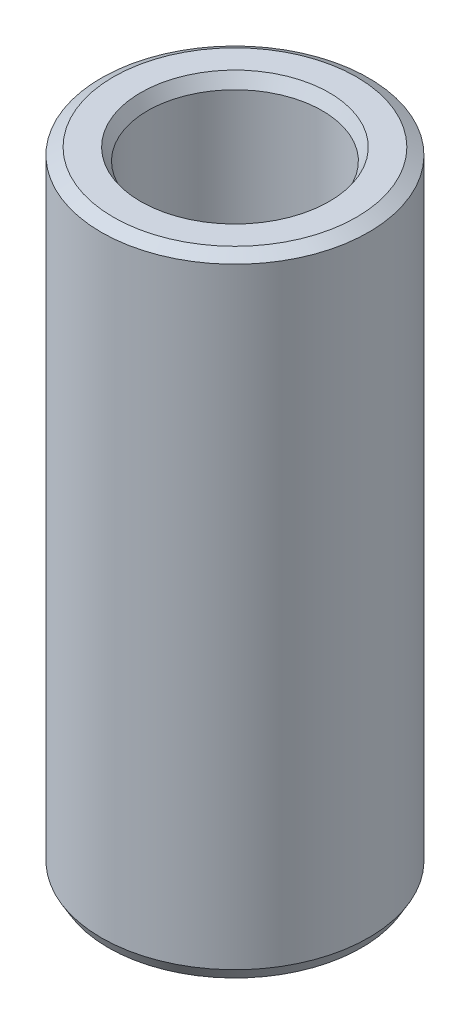
ISO-10303-21;
HEADER;
FILE_DESCRIPTION(('STEP AP214'),'2;1');
FILE_NAME('part.step','',(''),(''),'','','');
FILE_SCHEMA(('AUTOMOTIVE_DESIGN { 1 0 10303 214 1 1 1 1 }'));
ENDSEC;
DATA;
#1=APPLICATION_CONTEXT('core data for automotive mechanical design processes');
#2=APPLICATION_PROTOCOL_DEFINITION('international standard','automotive_design',2000,#1);
#3=PRODUCT_CONTEXT('',#1,'mechanical');
#4=PRODUCT('Part','Part','',(#3));
#5=PRODUCT_RELATED_PRODUCT_CATEGORY('part','',(#4));
#6=PRODUCT_DEFINITION_FORMATION('','',#4);
#7=PRODUCT_DEFINITION_CONTEXT('part definition',#1,'design');
#8=PRODUCT_DEFINITION('design','',#6,#7);
#9=PRODUCT_DEFINITION_SHAPE('','',#8);
#10=(LENGTH_UNIT() NAMED_UNIT(*) SI_UNIT(.MILLI.,.METRE.));
#11=(NAMED_UNIT(*) PLANE_ANGLE_UNIT() SI_UNIT($,.RADIAN.));
#12=(NAMED_UNIT(*) SI_UNIT($,.STERADIAN.) SOLID_ANGLE_UNIT());
#13=UNCERTAINTY_MEASURE_WITH_UNIT(LENGTH_MEASURE(1.E-05),#10,'distance_accuracy_value','');
#14=(GEOMETRIC_REPRESENTATION_CONTEXT(3) GLOBAL_UNCERTAINTY_ASSIGNED_CONTEXT((#13)) GLOBAL_UNIT_ASSIGNED_CONTEXT((#10,
#11,#12)) REPRESENTATION_CONTEXT('',''));
#15=CARTESIAN_POINT('',(0.,0.,0.));
#16=DIRECTION('',(0.,0.,1.));
#17=DIRECTION('',(1.,0.,0.));
#18=AXIS2_PLACEMENT_3D('',#15,#16,#17);
#19=CARTESIAN_POINT('',(0.,47.1369382725284,0.));
#20=DIRECTION('',(0.,-1.,0.));
#21=DIRECTION('',(0.,0.,-1.));
#22=AXIS2_PLACEMENT_3D('',#19,#20,#21);
#23=CYLINDRICAL_SURFACE('',#22,10.);
#24=CARTESIAN_POINT('',(0.,0.905532710523009,0.));
#25=DIRECTION('',(0.,1.,0.));
#26=DIRECTION('',(0.,0.,1.));
#27=AXIS2_PLACEMENT_3D('',#24,#25,#26);
#28=CIRCLE('',#27,10.);
#29=CARTESIAN_POINT('',(0.,0.905532710523009,10.));
#30=VERTEX_POINT('',#29);
#31=EDGE_CURVE('E10',#30,#30,#28,.T.);
#32=ORIENTED_EDGE('',*,*,#31,.T.);
#33=EDGE_LOOP('',(#32));
#34=FACE_BOUND('',#33,.T.);
#35=CARTESIAN_POINT('',(0.,46.6141287183479,0.));
#36=DIRECTION('',(0.,1.,0.));
#37=DIRECTION('',(0.,0.,1.));
#38=AXIS2_PLACEMENT_3D('',#35,#36,#37);
#39=CIRCLE('',#38,10.);
#40=CARTESIAN_POINT('',(0.,46.6141287183479,10.));
#41=VERTEX_POINT('',#40);
#42=EDGE_CURVE('E50',#41,#41,#39,.F.);
#43=ORIENTED_EDGE('',*,*,#42,.T.);
#44=EDGE_LOOP('',(#43));
#45=FACE_BOUND('',#44,.T.);
#46=ADVANCED_FACE('F39',(#34,#45),#23,.T.);
#47=CARTESIAN_POINT('',(0.,47.1369382725284,0.));
#48=DIRECTION('',(0.,1.,0.));
#49=DIRECTION('',(0.,0.,1.));
#50=AXIS2_PLACEMENT_3D('',#47,#48,#49);
#51=PLANE('',#50);
#52=CARTESIAN_POINT('',(0.,47.1369382725284,0.));
#53=DIRECTION('',(0.,1.,0.));
#54=DIRECTION('',(0.,0.,1.));
#55=AXIS2_PLACEMENT_3D('',#52,#53,#54);
#56=CIRCLE('',#55,7.05611461603216);
#57=CARTESIAN_POINT('',(0.,47.1369382725284,7.05611461603216));
#58=VERTEX_POINT('',#57);
#59=EDGE_CURVE('E58',#58,#58,#56,.F.);
#60=ORIENTED_EDGE('',*,*,#59,.T.);
#61=EDGE_LOOP('',(#60));
#62=FACE_BOUND('',#61,.T.);
#63=CARTESIAN_POINT('',(0.,47.1369382725284,0.));
#64=DIRECTION('',(0.,1.,0.));
#65=DIRECTION('',(0.,0.,1.));
#66=AXIS2_PLACEMENT_3D('',#63,#64,#65);
#67=CIRCLE('',#66,9.09446728947699);
#68=CARTESIAN_POINT('',(0.,47.1369382725284,9.09446728947699));
#69=VERTEX_POINT('',#68);
#70=EDGE_CURVE('E61',#69,#69,#67,.T.);
#71=ORIENTED_EDGE('',*,*,#70,.T.);
#72=EDGE_LOOP('',(#71));
#73=FACE_BOUND('',#72,.T.);
#74=ADVANCED_FACE('F88',(#62,#73),#51,.T.);
#75=CARTESIAN_POINT('',(0.,0.,0.));
#76=DIRECTION('',(0.,1.,0.));
#77=DIRECTION('',(0.,0.,1.));
#78=AXIS2_PLACEMENT_3D('',#75,#76,#77);
#79=PLANE('',#78);
#80=CARTESIAN_POINT('',(0.,0.,0.));
#81=DIRECTION('',(0.,1.,0.));
#82=DIRECTION('',(0.,0.,1.));
#83=AXIS2_PLACEMENT_3D('',#80,#81,#82);
#84=CIRCLE('',#83,7.43883777237472);
#85=CARTESIAN_POINT('',(0.,0.,7.43883777237472));
#86=VERTEX_POINT('',#85);
#87=EDGE_CURVE('E51',#86,#86,#84,.T.);
#88=ORIENTED_EDGE('',*,*,#87,.T.);
#89=EDGE_LOOP('',(#88));
#90=FACE_BOUND('',#89,.T.);
#91=CARTESIAN_POINT('',(0.,0.,0.));
#92=DIRECTION('',(0.,1.,0.));
#93=DIRECTION('',(0.,0.,1.));
#94=AXIS2_PLACEMENT_3D('',#91,#92,#93);
#95=CIRCLE('',#94,9.47719044581953);
#96=CARTESIAN_POINT('',(0.,0.,9.47719044581953));
#97=VERTEX_POINT('',#96);
#98=EDGE_CURVE('E54',#97,#97,#95,.F.);
#99=ORIENTED_EDGE('',*,*,#98,.T.);
#100=EDGE_LOOP('',(#99));
#101=FACE_BOUND('',#100,.T.);
#102=ADVANCED_FACE('F83',(#90,#101),#79,.F.);
#103=CARTESIAN_POINT('',(0.,47.1369382725284,0.));
#104=DIRECTION('',(0.,-1.,0.));
#105=DIRECTION('',(0.,0.,-1.));
#106=AXIS2_PLACEMENT_3D('',#103,#104,#105);
#107=CYLINDRICAL_SURFACE('',#106,6.5333050618517);
#108=CARTESIAN_POINT('',(0.,46.2314055620054,0.));
#109=DIRECTION('',(0.,1.,0.));
#110=DIRECTION('',(0.,0.,1.));
#111=AXIS2_PLACEMENT_3D('',#108,#109,#110);
#112=CIRCLE('',#111,6.5333050618517);
#113=CARTESIAN_POINT('',(0.,46.2314055620054,6.5333050618517));
#114=VERTEX_POINT('',#113);
#115=EDGE_CURVE('E67',#114,#114,#112,.T.);
#116=ORIENTED_EDGE('',*,*,#115,.T.);
#117=EDGE_LOOP('',(#116));
#118=FACE_BOUND('',#117,.T.);
#119=CARTESIAN_POINT('',(0.,0.522809554180478,0.));
#120=DIRECTION('',(0.,1.,0.));
#121=DIRECTION('',(0.,0.,1.));
#122=AXIS2_PLACEMENT_3D('',#119,#120,#121);
#123=CIRCLE('',#122,6.5333050618517);
#124=CARTESIAN_POINT('',(0.,0.522809554180478,6.5333050618517));
#125=VERTEX_POINT('',#124);
#126=EDGE_CURVE('E69',#125,#125,#123,.F.);
#127=ORIENTED_EDGE('',*,*,#126,.T.);
#128=EDGE_LOOP('',(#127));
#129=FACE_BOUND('',#128,.T.);
#130=ADVANCED_FACE('F71',(#118,#129),#107,.F.);
#131=CARTESIAN_POINT('',(0.,46.2314055620054,0.));
#132=DIRECTION('',(0.,1.,0.));
#133=DIRECTION('',(0.,0.,1.));
#134=AXIS2_PLACEMENT_3D('',#131,#132,#133);
#135=CONICAL_SURFACE('',#134,6.5333050618517,0.523598775598297);
#136=ORIENTED_EDGE('',*,*,#59,.F.);
#137=EDGE_LOOP('',(#136));
#138=FACE_BOUND('',#137,.T.);
#139=ORIENTED_EDGE('',*,*,#115,.F.);
#140=EDGE_LOOP('',(#139));
#141=FACE_BOUND('',#140,.T.);
#142=ADVANCED_FACE('F77',(#138,#141),#135,.F.);
#143=CARTESIAN_POINT('',(0.,0.,0.));
#144=DIRECTION('',(0.,-1.,0.));
#145=DIRECTION('',(0.,0.,-1.));
#146=AXIS2_PLACEMENT_3D('',#143,#144,#145);
#147=CONICAL_SURFACE('',#146,7.43883777237472,1.0471975511966);
#148=ORIENTED_EDGE('',*,*,#126,.F.);
#149=EDGE_LOOP('',(#148));
#150=FACE_BOUND('',#149,.T.);
#151=ORIENTED_EDGE('',*,*,#87,.F.);
#152=EDGE_LOOP('',(#151));
#153=FACE_BOUND('',#152,.T.);
#154=ADVANCED_FACE('F73',(#150,#153),#147,.F.);
#155=CARTESIAN_POINT('',(0.,0.905532710523009,0.));
#156=DIRECTION('',(0.,1.,0.));
#157=DIRECTION('',(0.,0.,1.));
#158=AXIS2_PLACEMENT_3D('',#155,#156,#157);
#159=CONICAL_SURFACE('',#158,10.,0.523598775598302);
#160=ORIENTED_EDGE('',*,*,#98,.F.);
#161=EDGE_LOOP('',(#160));
#162=FACE_BOUND('',#161,.T.);
#163=ORIENTED_EDGE('',*,*,#31,.F.);
#164=EDGE_LOOP('',(#163));
#165=FACE_BOUND('',#164,.T.);
#166=ADVANCED_FACE('F76',(#162,#165),#159,.T.);
#167=CARTESIAN_POINT('',(0.,47.1369382725284,0.));
#168=DIRECTION('',(0.,-1.,0.));
#169=DIRECTION('',(0.,0.,-1.));
#170=AXIS2_PLACEMENT_3D('',#167,#168,#169);
#171=CONICAL_SURFACE('',#170,9.09446728947699,1.0471975511966);
#172=ORIENTED_EDGE('',*,*,#42,.F.);
#173=EDGE_LOOP('',(#172));
#174=FACE_BOUND('',#173,.T.);
#175=ORIENTED_EDGE('',*,*,#70,.F.);
#176=EDGE_LOOP('',(#175));
#177=FACE_BOUND('',#176,.T.);
#178=ADVANCED_FACE('F45',(#174,#177),#171,.T.);
#179=CLOSED_SHELL('',(#46,#74,#102,#130,#142,#154,#166,#178));
#180=MANIFOLD_SOLID_BREP('B2',#179);
#181=ADVANCED_BREP_SHAPE_REPRESENTATION('',(#18,#180),#14);
#182=SHAPE_DEFINITION_REPRESENTATION(#9,#181);
ENDSEC;
END-ISO-10303-21;
